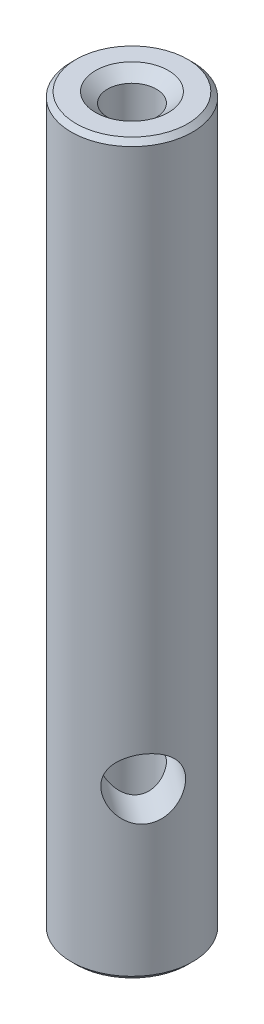
ISO-10303-21;
HEADER;
FILE_DESCRIPTION(('STEP AP214'),'2;1');
FILE_NAME('part.step','',(''),(''),'','','');
FILE_SCHEMA(('AUTOMOTIVE_DESIGN { 1 0 10303 214 1 1 1 1 }'));
ENDSEC;
DATA;
#1=APPLICATION_CONTEXT('core data for automotive mechanical design processes');
#2=APPLICATION_PROTOCOL_DEFINITION('international standard','automotive_design',2000,#1);
#3=PRODUCT_CONTEXT('',#1,'mechanical');
#4=PRODUCT('Part','Part','',(#3));
#5=PRODUCT_RELATED_PRODUCT_CATEGORY('part','',(#4));
#6=PRODUCT_DEFINITION_FORMATION('','',#4);
#7=PRODUCT_DEFINITION_CONTEXT('part definition',#1,'design');
#8=PRODUCT_DEFINITION('design','',#6,#7);
#9=PRODUCT_DEFINITION_SHAPE('','',#8);
#10=(LENGTH_UNIT() NAMED_UNIT(*) SI_UNIT(.MILLI.,.METRE.));
#11=(NAMED_UNIT(*) PLANE_ANGLE_UNIT() SI_UNIT($,.RADIAN.));
#12=(NAMED_UNIT(*) SI_UNIT($,.STERADIAN.) SOLID_ANGLE_UNIT());
#13=UNCERTAINTY_MEASURE_WITH_UNIT(LENGTH_MEASURE(1.E-05),#10,'distance_accuracy_value','');
#14=(GEOMETRIC_REPRESENTATION_CONTEXT(3) GLOBAL_UNCERTAINTY_ASSIGNED_CONTEXT((#13)) GLOBAL_UNIT_ASSIGNED_CONTEXT((#10,
#11,#12)) REPRESENTATION_CONTEXT('',''));
#15=CARTESIAN_POINT('',(0.,0.,0.));
#16=DIRECTION('',(0.,0.,1.));
#17=DIRECTION('',(1.,0.,0.));
#18=AXIS2_PLACEMENT_3D('',#15,#16,#17);
#19=CARTESIAN_POINT('',(-2.84217017566743E-11,76.1999999999858,0.));
#20=DIRECTION('',(0.,1.,0.));
#21=DIRECTION('',(0.,0.,1.));
#22=AXIS2_PLACEMENT_3D('',#19,#20,#21);
#23=CYLINDRICAL_SURFACE('',#22,2.55269999999999);
#24=CARTESIAN_POINT('',(-2.84217017566743E-11,15.0125473605394,2.55269999999999));
#25=CARTESIAN_POINT('',(0.146141609429039,14.9389517833548,2.5527050378974));
#26=CARTESIAN_POINT('',(0.29214035526825,14.8649018803599,2.54021818408022));
#27=CARTESIAN_POINT('',(0.582563562513722,14.7223370614548,2.48969257237443));
#28=CARTESIAN_POINT('',(0.726988050673868,14.6538220513539,2.45165424941309));
#29=CARTESIAN_POINT('',(0.984594154374997,14.5399736099591,2.35837658270555));
#30=CARTESIAN_POINT('',(1.09856062296888,14.4927019008149,2.30769389084834));
#31=CARTESIAN_POINT('',(1.32084218035541,14.4089016787977,2.18803734737841));
#32=CARTESIAN_POINT('',(1.42916238761089,14.3723632915375,2.11908041942248));
#33=CARTESIAN_POINT('',(1.58501902092242,14.3277733212582,2.00207104398003));
#34=CARTESIAN_POINT('',(1.63610134550729,14.31457373978,1.96056798220516));
#35=CARTESIAN_POINT('',(1.73535435039593,14.291996930548,1.87328069230012));
#36=CARTESIAN_POINT('',(1.78352652963935,14.2826177204751,1.8274986996282));
#37=CARTESIAN_POINT('',(1.87642096717843,14.2679368312076,1.73198068498581));
#38=CARTESIAN_POINT('',(1.92114453345136,14.2626335991792,1.68224617678918));
#39=CARTESIAN_POINT('',(2.00665242793614,14.2562401051936,1.57927496946938));
#40=CARTESIAN_POINT('',(2.04743730918874,14.2551492509247,1.52603876379831));
#41=CARTESIAN_POINT('',(2.15252455475854,14.2579859168976,1.37701606989338));
#42=CARTESIAN_POINT('',(2.21257580488203,14.2660997952565,1.27823058669012));
#43=CARTESIAN_POINT('',(2.31818854223108,14.2943142084616,1.07491275664707));
#44=CARTESIAN_POINT('',(2.36374932332287,14.3144153273197,0.970380130034774));
#45=CARTESIAN_POINT('',(2.43990338849989,14.3649986534765,0.758790147356919));
#46=CARTESIAN_POINT('',(2.47053373457456,14.3954548336196,0.651739741561188));
#47=CARTESIAN_POINT('',(2.51736713459012,14.4647982081429,0.43727545351543));
#48=CARTESIAN_POINT('',(2.53356465993425,14.5036886262326,0.329861447787217));
#49=CARTESIAN_POINT('',(2.55621652043224,14.6054549653817,0.0716965003333163));
#50=CARTESIAN_POINT('',(2.55576308151449,14.6715598958569,-0.0783914472887838));
#51=CARTESIAN_POINT('',(2.52961811478431,14.81092710978,-0.373280719107817));
#52=CARTESIAN_POINT('',(2.50385458747057,14.8842092747987,-0.518065739172711));
#53=CARTESIAN_POINT('',(2.44690531725036,14.9952722035224,-0.731049062962099));
#54=CARTESIAN_POINT('',(2.42461996666571,15.0327851552158,-0.801888838798563));
#55=CARTESIAN_POINT('',(2.37380357757439,15.1070891364445,-0.941739749004508));
#56=CARTESIAN_POINT('',(2.34527074855821,15.1438799557183,-1.01075035276906));
#57=CARTESIAN_POINT('',(2.28190514386588,15.2155061637808,-1.14664447695307));
#58=CARTESIAN_POINT('',(2.24708712524487,15.2503458877057,-1.21353255728077));
#59=CARTESIAN_POINT('',(2.17087723029983,15.3167167992525,-1.34511945437044));
#60=CARTESIAN_POINT('',(2.12949034473803,15.3482504687197,-1.40981988831004));
#61=CARTESIAN_POINT('',(2.03210985308377,15.4112179616136,-1.54760605605801));
#62=CARTESIAN_POINT('',(1.97482867529169,15.4417122391818,-1.6202332705475));
#63=CARTESIAN_POINT('',(1.85067735942271,15.4921364323467,-1.76068567087731));
#64=CARTESIAN_POINT('',(1.78383075606168,15.5120917287466,-1.82852204957307));
#65=CARTESIAN_POINT('',(1.6405645177049,15.5382393319012,-1.95811583398898));
#66=CARTESIAN_POINT('',(1.56405293955071,15.5442870141392,-2.01980303446706));
#67=CARTESIAN_POINT('',(1.40461853489662,15.5408572836788,-2.13376156060525));
#68=CARTESIAN_POINT('',(1.32169307869045,15.5313734705339,-2.18602899457595));
#69=CARTESIAN_POINT('',(1.1435888976898,15.4971602576053,-2.28472098452314));
#70=CARTESIAN_POINT('',(1.04804580298729,15.4709146681032,-2.32993031209417));
#71=CARTESIAN_POINT('',(0.855466487743006,15.4068592766374,-2.40734215790049));
#72=CARTESIAN_POINT('',(0.758426628001149,15.3690147732948,-2.43950496365171));
#73=CARTESIAN_POINT('',(0.588027364720411,15.296579037329,-2.4852065687524));
#74=CARTESIAN_POINT('',(0.514705898308889,15.2634718612955,-2.50137944014867));
#75=CARTESIAN_POINT('',(0.368031887906415,15.1948107759218,-2.52712761075387));
#76=CARTESIAN_POINT('',(0.294679346359718,15.1592556716299,-2.53669966230818));
#77=CARTESIAN_POINT('',(0.0745450464363469,15.0507299762198,-2.55586849629838));
#78=CARTESIAN_POINT('',(-0.0722541762948927,14.9759262309444,-2.55590251479451));
#79=CARTESIAN_POINT('',(-0.3699449179414,14.8263824593368,-2.53031355493529));
#80=CARTESIAN_POINT('',(-0.52080508977164,14.7517317582735,-2.50381478978742));
#81=CARTESIAN_POINT('',(-0.819186078418884,14.6118719592777,-2.42259702590156));
#82=CARTESIAN_POINT('',(-0.966714087875294,14.5466404676047,-2.36794641988778));
#83=CARTESIAN_POINT('',(-1.21582490193896,14.447300309655,-2.24761641384153));
#84=CARTESIAN_POINT('',(-1.31921574240825,14.4095257585208,-2.18870651711589));
#85=CARTESIAN_POINT('',(-1.51905023685118,14.3451394588842,-2.05503657595557));
#86=CARTESIAN_POINT('',(-1.61549884099471,14.3185196898157,-1.98028797836991));
#87=CARTESIAN_POINT('',(-1.7987111417712,14.2785218956048,-1.81553600876565));
#88=CARTESIAN_POINT('',(-1.88541265737466,14.2652250287037,-1.72544300587306));
#89=CARTESIAN_POINT('',(-2.0450140494866,14.253453360466,-1.53290858299129));
#90=CARTESIAN_POINT('',(-2.11791877997305,14.2549733363556,-1.43047152671874));
#91=CARTESIAN_POINT('',(-2.2411767930974,14.2718007878859,-1.22725921644502));
#92=CARTESIAN_POINT('',(-2.29302292009457,14.2857709922146,-1.127268058708));
#93=CARTESIAN_POINT('',(-2.38253544311417,14.3245728082774,-0.923161934280335));
#94=CARTESIAN_POINT('',(-2.42019836133303,14.3494070807202,-0.819045963069877));
#95=CARTESIAN_POINT('',(-2.48265775629505,14.4095413995945,-0.604728910223966));
#96=CARTESIAN_POINT('',(-2.50681894186361,14.4452519407323,-0.494460944765003));
#97=CARTESIAN_POINT('',(-2.54033101194841,14.5244534664354,-0.274555641485946));
#98=CARTESIAN_POINT('',(-2.54968000042993,14.5679454462706,-0.164918386189279));
#99=CARTESIAN_POINT('',(-2.55491023636049,14.6688502292071,0.0718812013526048));
#100=CARTESIAN_POINT('',(-2.54805273888281,14.7273584189553,0.198630574016319));
#101=CARTESIAN_POINT('',(-2.51622719500429,14.8486389964388,0.448036338301459));
#102=CARTESIAN_POINT('',(-2.4912179533282,14.9114207888803,0.570682754823789));
#103=CARTESIAN_POINT('',(-2.43684666482846,15.0127057010437,0.764103044556728));
#104=CARTESIAN_POINT('',(-2.41296228311867,15.0511530203734,0.836496357894728));
#105=CARTESIAN_POINT('',(-2.35860156572929,15.1271042353673,0.979347137712694));
#106=CARTESIAN_POINT('',(-2.3281222561036,15.1646076968589,1.04980371462425));
#107=CARTESIAN_POINT('',(-2.26047705694085,15.237296500229,1.18846917586932));
#108=CARTESIAN_POINT('',(-2.22332554574836,15.2724866088081,1.25668252746152));
#109=CARTESIAN_POINT('',(-2.14202902032723,15.3389883750079,1.39072916703798));
#110=CARTESIAN_POINT('',(-2.09789074951889,15.370303721039,1.45656467555936));
#111=CARTESIAN_POINT('',(-1.99655851387521,15.4304245928658,1.59313755043696));
#112=CARTESIAN_POINT('',(-1.93843654380419,15.4584902495188,1.66352837776898));
#113=CARTESIAN_POINT('',(-1.81305699739585,15.5037578489058,1.79933251356289));
#114=CARTESIAN_POINT('',(-1.74582490211265,15.5209893623915,1.86475893834037));
#115=CARTESIAN_POINT('',(-1.60257537977622,15.5417703819021,1.9892422183485));
#116=CARTESIAN_POINT('',(-1.52648598084436,15.5451983957279,2.04823808587992));
#117=CARTESIAN_POINT('',(-1.36859225356079,15.5372998307801,2.15695289955908));
#118=CARTESIAN_POINT('',(-1.28678153540315,15.5259564974486,2.20666123805558));
#119=CARTESIAN_POINT('',(-1.10709339146655,15.4879322360277,2.3027405876346));
#120=CARTESIAN_POINT('',(-1.00873502632267,15.4590930537089,2.34731390778756));
#121=CARTESIAN_POINT('',(-0.810806079883369,15.3900443474253,2.42284118092027));
#122=CARTESIAN_POINT('',(-0.711233303182707,15.3498098821154,2.45376487424116));
#123=CARTESIAN_POINT('',(-0.509653507504326,15.2618011795455,2.50350755545527));
#124=CARTESIAN_POINT('',(-0.407642861489981,15.213875649083,2.52203376519614));
#125=CARTESIAN_POINT('',(-0.203731693442817,15.1148892582484,2.54662782481672));
#126=CARTESIAN_POINT('',(-0.101831164642575,15.0638286031847,2.55269648960372));
#127=CARTESIAN_POINT('',(-2.84217017566743E-11,15.0125473605394,2.55269999999999));
#128=B_SPLINE_CURVE_WITH_KNOTS('',3,(#24,#25,#26,#27,#28,#29,#30,#31,#32,#33,#34,#35,#36,#37,
#38,#39,#40,#41,#42,#43,#44,#45,#46,#47,#48,#49,#50,#51,#52,#53,#54,#55,#56,#57,#58,#59,#60,#61,
#62,#63,#64,#65,#66,#67,#68,#69,#70,#71,#72,#73,#74,#75,#76,#77,#78,#79,#80,#81,#82,#83,#84,#85,
#86,#87,#88,#89,#90,#91,#92,#93,#94,#95,#96,#97,#98,#99,#100,#101,#102,#103,#104,#105,#106,#107,
#108,#109,#110,#111,#112,#113,#114,#115,#116,#117,#118,#119,#120,#121,#122,#123,#124,#125,#126,
#127),.UNSPECIFIED.,.T.,.F.,(4,2,2,2,2,2,2,2,2,2,2,2,2,2,2,2,2,2,2,2,2,2,2,2,2,2,2,2,2,2,2,2,2,
2,2,2,2,2,2,2,2,2,2,2,2,2,2,2,2,2,2,4),(0.,0.490542736328622,0.981077123039199,1.37972713135249,
1.77800923475073,1.97913385756872,2.18015398724001,2.38109749584291,2.58201274830891,
2.92781957701772,3.27364325462768,3.61860406224461,3.96369695286796,4.4531131227117,
4.94392557603005,5.19331828095783,5.44278255489782,5.69166855248637,5.94036635372294,
6.23160052983494,6.52213009722256,6.81566746361247,7.10932582562801,7.43426107957347,
7.76017811738336,8.00604347774957,8.25202971963977,8.74420081330226,9.2531711231626,
9.76091072004044,10.1339846667578,10.5067899018139,10.881852569332,11.2567830361748,
11.5957291461376,11.9347583135837,12.2886261988468,12.6425393772964,13.0604016496602,
13.4792152351628,13.7351103279579,13.991121056615,14.2465865707653,14.5018070036889,
14.7873408325788,15.0720919020333,15.3593438153143,15.6469218311102,15.9803804449556,
16.3145746304091,16.6564061339072,16.9982152758676),.UNSPECIFIED.);
#129=CARTESIAN_POINT('',(-2.84217017566743E-11,15.0125473605394,2.55269999999999));
#130=VERTEX_POINT('',#129);
#131=EDGE_CURVE('E72',#130,#130,#128,.T.);
#132=ORIENTED_EDGE('',*,*,#131,.T.);
#133=EDGE_LOOP('',(#132));
#134=FACE_BOUND('',#133,.T.);
#135=CARTESIAN_POINT('',(-2.84217017566743E-11,2.8421709430404E-11,0.));
#136=DIRECTION('',(0.,-1.,0.));
#137=DIRECTION('',(1.,0.,0.));
#138=AXIS2_PLACEMENT_3D('',#135,#136,#137);
#139=CIRCLE('',#138,2.55269999999999);
#140=CARTESIAN_POINT('',(2.55269999997157,2.8421709430404E-11,0.));
#141=VERTEX_POINT('',#140);
#142=EDGE_CURVE('E109',#141,#141,#139,.T.);
#143=ORIENTED_EDGE('',*,*,#142,.T.);
#144=EDGE_LOOP('',(#143));
#145=FACE_BOUND('',#144,.T.);
#146=ADVANCED_FACE('F33',(#134,#145),#23,.F.);
#147=CARTESIAN_POINT('',(-2.84217017566743E-11,0.50800000000005,0.));
#148=DIRECTION('',(0.,1.,0.));
#149=DIRECTION('',(-1.,0.,0.));
#150=AXIS2_PLACEMENT_3D('',#147,#148,#149);
#151=CONICAL_SURFACE('',#150,6.34618999999158,0.785398163397448);
#152=CARTESIAN_POINT('',(-2.84217017566743E-11,2.84217017566743E-11,0.));
#153=DIRECTION('',(0.,1.,0.));
#154=DIRECTION('',(-1.,0.,0.));
#155=AXIS2_PLACEMENT_3D('',#152,#153,#154);
#156=CIRCLE('',#155,5.83819000001995);
#157=CARTESIAN_POINT('',(-5.83819000004837,2.84217017566743E-11,0.));
#158=VERTEX_POINT('',#157);
#159=EDGE_CURVE('E110',#158,#158,#156,.T.);
#160=ORIENTED_EDGE('',*,*,#159,.T.);
#161=EDGE_LOOP('',(#160));
#162=FACE_BOUND('',#161,.T.);
#163=CARTESIAN_POINT('',(-2.84217017566743E-11,0.50800000000005,0.));
#164=DIRECTION('',(0.,1.,0.));
#165=DIRECTION('',(-1.,0.,0.));
#166=AXIS2_PLACEMENT_3D('',#163,#164,#165);
#167=CIRCLE('',#166,6.34618999999158);
#168=CARTESIAN_POINT('',(-6.34619000002,0.50800000000005,0.));
#169=VERTEX_POINT('',#168);
#170=EDGE_CURVE('E44',#169,#169,#167,.T.);
#171=ORIENTED_EDGE('',*,*,#170,.F.);
#172=EDGE_LOOP('',(#171));
#173=FACE_BOUND('',#172,.T.);
#174=ADVANCED_FACE('F35',(#162,#173),#151,.T.);
#175=CARTESIAN_POINT('',(-2.84217017566743E-11,2.84217017566743E-11,0.));
#176=DIRECTION('',(0.,1.,0.));
#177=DIRECTION('',(-1.,0.,0.));
#178=AXIS2_PLACEMENT_3D('',#175,#176,#177);
#179=CYLINDRICAL_SURFACE('',#178,6.34618999999158);
#180=CARTESIAN_POINT('',(2.54898186204476,17.4308110776537,5.81178277147513));
#181=CARTESIAN_POINT('',(2.54898323327409,17.3480569051967,5.81178261252406));
#182=CARTESIAN_POINT('',(2.5524146541681,17.2652927410018,5.81028164607859));
#183=CARTESIAN_POINT('',(2.56604294826318,17.1004222060484,5.804273955856));
#184=CARTESIAN_POINT('',(2.5762429659765,17.0183161589855,5.79976583502888));
#185=CARTESIAN_POINT('',(2.61672718300756,16.7737089550719,5.78167874216645));
#186=CARTESIAN_POINT('',(2.65689497225097,16.6130632684836,5.76353695910043));
#187=CARTESIAN_POINT('',(2.75980548853309,16.3023270691888,5.7149588908769));
#188=CARTESIAN_POINT('',(2.82242801763556,16.1521853489907,5.68458796263755));
#189=CARTESIAN_POINT('',(2.96595544048954,15.8643616377343,5.61103627880535));
#190=CARTESIAN_POINT('',(3.04686134211383,15.7266803341438,5.56785481698945));
#191=CARTESIAN_POINT('',(3.22993377052522,15.4551751112135,5.46384583402254));
#192=CARTESIAN_POINT('',(3.33330428541027,15.3226087134638,5.4018555488421));
#193=CARTESIAN_POINT('',(3.5513392693962,15.0770194721092,5.26107993793078));
#194=CARTESIAN_POINT('',(3.66600933322451,14.9640063869939,5.18228626966261));
#195=CARTESIAN_POINT('',(3.90967449063226,14.7532676131003,5.00130926524752));
#196=CARTESIAN_POINT('',(4.03911404876404,14.6570889897904,4.89790602565587));
#197=CARTESIAN_POINT('',(4.29902249220796,14.493581009333,4.67141940456164));
#198=CARTESIAN_POINT('',(4.42949067388308,14.4262334241323,4.5483485254733));
#199=CARTESIAN_POINT('',(4.67603856447904,14.3272805045371,4.29393726524444));
#200=CARTESIAN_POINT('',(4.79248122462589,14.2934710666038,4.16381023388753));
#201=CARTESIAN_POINT('',(5.0159322105137,14.2552946194394,3.89171805608946));
#202=CARTESIAN_POINT('',(5.12294621369068,14.2509097710486,3.74976013519462));
#203=CARTESIAN_POINT('',(5.314925530563,14.2708582761023,3.47156717230399));
#204=CARTESIAN_POINT('',(5.40099930564727,14.2927245832474,3.33590990905291));
#205=CARTESIAN_POINT('',(5.56032217584155,14.360138467768,3.06299167207883));
#206=CARTESIAN_POINT('',(5.63357031064194,14.4056878173798,2.92573057909045));
#207=CARTESIAN_POINT('',(5.76757384395485,14.5194687677039,2.6519416148298));
#208=CARTESIAN_POINT('',(5.82814256902507,14.5880051877049,2.5154501031073));
#209=CARTESIAN_POINT('',(5.93601237850887,14.7453894905337,2.24912421745351));
#210=CARTESIAN_POINT('',(5.98330870128563,14.8342446422597,2.11929224633051));
#211=CARTESIAN_POINT('',(6.06977726972029,15.0394117203801,1.85811675805679));
#212=CARTESIAN_POINT('',(6.10775752598081,15.157525996736,1.72779239140684));
#213=CARTESIAN_POINT('',(6.17152935428662,15.4129951593708,1.4840020996888));
#214=CARTESIAN_POINT('',(6.19731155071015,15.5503647408048,1.37054918806195));
#215=CARTESIAN_POINT('',(6.2405026871654,15.8513135799743,1.15874608007677));
#216=CARTESIAN_POINT('',(6.25727436713653,16.0160044430721,1.06181642640694));
#217=CARTESIAN_POINT('',(6.27638579027964,16.2741917250117,0.939578023608944));
#218=CARTESIAN_POINT('',(6.28174905785842,16.362131692208,0.902686083279713));
#219=CARTESIAN_POINT('',(6.29079524695091,16.5411528467123,0.837325344134645));
#220=CARTESIAN_POINT('',(6.29447920591737,16.6322320571265,0.80885134866542));
#221=CARTESIAN_POINT('',(6.30021054839894,16.8095126866093,0.762868607756308));
#222=CARTESIAN_POINT('',(6.30236400882379,16.8955330136969,0.744672668994656));
#223=CARTESIAN_POINT('',(6.30564218338009,17.0688775260192,0.716385141235708));
#224=CARTESIAN_POINT('',(6.30676743285755,17.1562010086573,0.706289335175847));
#225=CARTESIAN_POINT('',(6.30808438344694,17.3313931623484,0.694433232986087));
#226=CARTESIAN_POINT('',(6.30827643360786,17.4192616172478,0.692669820258223));
#227=CARTESIAN_POINT('',(6.30774274276635,17.5947380960239,0.697499309718456));
#228=CARTESIAN_POINT('',(6.30701706389248,17.6823461371277,0.704091646237829));
#229=CARTESIAN_POINT('',(6.30364947506107,17.9244747539179,0.733866552960442));
#230=CARTESIAN_POINT('',(6.29995530954081,18.0779663803931,0.765971475926918));
#231=CARTESIAN_POINT('',(6.28861303789462,18.3776688456908,0.854046119764477));
#232=CARTESIAN_POINT('',(6.28096364919271,18.5238773059008,0.910023580846323));
#233=CARTESIAN_POINT('',(6.25983589722089,18.8126955862098,1.04570259881783));
#234=CARTESIAN_POINT('',(6.24610400671688,18.9548252176271,1.12638274099009));
#235=CARTESIAN_POINT('',(6.21092688595921,19.2256059502302,1.30649444349513));
#236=CARTESIAN_POINT('',(6.18947768880845,19.3542500755164,1.40593563497067));
#237=CARTESIAN_POINT('',(6.13362509434063,19.6114078054789,1.63344516931152));
#238=CARTESIAN_POINT('',(6.09792820901346,19.7378548963292,1.76354264414182));
#239=CARTESIAN_POINT('',(6.01178515289824,19.9684622925735,2.03795079493238));
#240=CARTESIAN_POINT('',(5.96133399458648,20.0726150409505,2.1822662661767));
#241=CARTESIAN_POINT('',(5.84217163684326,20.2580125732565,2.48397213565325));
#242=CARTESIAN_POINT('',(5.77301178261527,20.3385768027511,2.64160774109461));
#243=CARTESIAN_POINT('',(5.61628360338484,20.4694980506625,2.96021882375603));
#244=CARTESIAN_POINT('',(5.52873155350879,20.5198816249172,3.12119123549864));
#245=CARTESIAN_POINT('',(5.34522325442687,20.5846636736303,3.42509797707477));
#246=CARTESIAN_POINT('',(5.25077688863443,20.6019415927001,3.56833138814324));
#247=CARTESIAN_POINT('',(5.05016776650217,20.6085137388476,3.84699391171806));
#248=CARTESIAN_POINT('',(4.94400913428837,20.5978177861605,3.98242574591092));
#249=CARTESIAN_POINT('',(4.73108741797625,20.5506516030801,4.23275134203897));
#250=CARTESIAN_POINT('',(4.62482700714659,20.5159297219663,4.34841073974499));
#251=CARTESIAN_POINT('',(4.4090580267121,20.4240564114695,4.56704949870963));
#252=CARTESIAN_POINT('',(4.29954899391063,20.3669017692197,4.67002704086977));
#253=CARTESIAN_POINT('',(4.07637982811242,20.2292459693696,4.8662388103024));
#254=CARTESIAN_POINT('',(3.96274229835076,20.1478514564257,4.95886856865993));
#255=CARTESIAN_POINT('',(3.74014454954153,19.9651403066869,5.12884892859431));
#256=CARTESIAN_POINT('',(3.63118650644422,19.8638145215203,5.20619248106094));
#257=CARTESIAN_POINT('',(3.41158908490591,19.6324444144576,5.35297314351558));
#258=CARTESIAN_POINT('',(3.3018636258708,19.5005446816285,5.42085493023726));
#259=CARTESIAN_POINT('',(3.09840446215224,19.2177314273344,5.53966871208602));
#260=CARTESIAN_POINT('',(3.0046849557482,19.0668012288077,5.59058569604841));
#261=CARTESIAN_POINT('',(2.8794041254054,18.8260858806462,5.65557019556782));
#262=CARTESIAN_POINT('',(2.83969631741779,18.7420143659253,5.67555233126463));
#263=CARTESIAN_POINT('',(2.76700441864716,18.5701746933921,5.71134438918446));
#264=CARTESIAN_POINT('',(2.73401686527789,18.4824084675386,5.72715646126065));
#265=CARTESIAN_POINT('',(2.67562857750121,18.3040181069106,5.75466596558073));
#266=CARTESIAN_POINT('',(2.65020834048433,18.2134019959436,5.76637398893116));
#267=CARTESIAN_POINT('',(2.60754565870225,18.0298913979354,5.78579173663697));
#268=CARTESIAN_POINT('',(2.59029749906276,17.9369985510089,5.79350425547103));
#269=CARTESIAN_POINT('',(2.56797069895927,17.7751479136484,5.80342623934202));
#270=CARTESIAN_POINT('',(2.56086151063149,17.706519610065,5.80656030281969));
#271=CARTESIAN_POINT('',(2.55136636213252,17.5688668985843,5.81073870514046));
#272=CARTESIAN_POINT('',(2.54898071820078,17.4998424644765,5.81178290406799));
#273=CARTESIAN_POINT('',(2.54898186204476,17.4308110776537,5.81178277147513));
#274=B_SPLINE_CURVE_WITH_KNOTS('',3,(#180,#181,#182,#183,#184,#185,#186,#187,#188,#189,#190,
#191,#192,#193,#194,#195,#196,#197,#198,#199,#200,#201,#202,#203,#204,#205,#206,#207,#208,#209,
#210,#211,#212,#213,#214,#215,#216,#217,#218,#219,#220,#221,#222,#223,#224,#225,#226,#227,#228,
#229,#230,#231,#232,#233,#234,#235,#236,#237,#238,#239,#240,#241,#242,#243,#244,#245,#246,#247,
#248,#249,#250,#251,#252,#253,#254,#255,#256,#257,#258,#259,#260,#261,#262,#263,#264,#265,#266,
#267,#268,#269,#270,#271,#272,#273),.UNSPECIFIED.,.T.,.F.,(4,2,2,2,2,2,2,2,2,2,2,2,2,2,2,2,2,2,
2,2,2,2,2,2,2,2,2,2,2,2,2,2,2,2,2,2,2,2,2,2,2,2,2,2,2,2,4),(0.,0.248186916575524,
0.496489215069263,0.993521260690589,1.48793151747673,1.98236903533008,2.517638451749,
3.05317423979837,3.62486308277466,4.19618994710279,4.72682370446812,5.25713572697523,
5.7412773741896,6.22545525563859,6.71632560901302,7.20737184364814,7.74487649783145,
8.28279361811226,8.85494225388807,9.14113314058491,9.4271469822429,9.69062561821036,
9.95396699368775,10.21720986275,10.4804349117102,10.948673159139,11.4170633393631,
11.9071439758319,12.3974768872906,12.9497078461558,13.5021256969785,14.069189462767,
14.6357535356872,15.1502941641982,15.6646541873305,16.1450540492872,16.6255227402327,
17.1265248437367,17.6277574440001,18.1789253055149,18.7305795761178,19.0155482113871,
19.3003696441842,19.5844505460175,19.8683324908886,20.075349727878,20.2823808241212),.UNSPECIFIED.);
#275=CARTESIAN_POINT('',(2.54898186204476,17.4308110776537,5.81178277147513));
#276=VERTEX_POINT('',#275);
#277=EDGE_CURVE('E37',#276,#276,#274,.T.);
#278=ORIENTED_EDGE('',*,*,#277,.F.);
#279=EDGE_LOOP('',(#278));
#280=FACE_BOUND('',#279,.T.);
#281=CARTESIAN_POINT('',(-6.30812514689882,17.4308110776537,-0.694035047684538));
#282=CARTESIAN_POINT('',(-6.30812540534921,17.5135652501108,-0.694036403685538));
#283=CARTESIAN_POINT('',(-6.30771946174829,17.5963294143056,-0.697759676360909));
#284=CARTESIAN_POINT('',(-6.30606290944521,17.761199949259,-0.7125609795542));
#285=CARTESIAN_POINT('',(-6.30481190814659,17.843305996322,-0.723642428489012));
#286=CARTESIAN_POINT('',(-6.29966132349498,18.0879132002355,-0.767683162299635));
#287=CARTESIAN_POINT('',(-6.29436391075932,18.2485588868238,-0.811438310611869));
#288=CARTESIAN_POINT('',(-6.27878938656816,18.5592950861187,-0.924167354207574));
#289=CARTESIAN_POINT('',(-6.26853868986794,18.7094368063167,-0.993007005938747));
#290=CARTESIAN_POINT('',(-6.24128198283391,18.9972605175731,-1.15196311065737));
#291=CARTESIAN_POINT('',(-6.22427560005303,19.1349418211636,-1.24208073660762));
#292=CARTESIAN_POINT('',(-6.17978344994018,19.4064470440939,-1.44788120104001));
#293=CARTESIAN_POINT('',(-6.15154824995145,19.5390134418437,-1.56506068851947));
#294=CARTESIAN_POINT('',(-6.0824295648973,19.7846026831983,-1.81521990631003));
#295=CARTESIAN_POINT('',(-6.04153979252789,19.8976157683136,-1.94820747043961));
#296=CARTESIAN_POINT('',(-5.94172578550691,20.1083545422071,-2.23484757416556));
#297=CARTESIAN_POINT('',(-5.88177042611225,20.2045331655171,-2.38928909723256));
#298=CARTESIAN_POINT('',(-5.74338830988848,20.3680411459745,-2.70504054761332));
#299=CARTESIAN_POINT('',(-5.66497327270906,20.4353887311751,-2.86634606411336));
#300=CARTESIAN_POINT('',(-5.49594874805748,20.5343416507703,-3.17770062366702));
#301=CARTESIAN_POINT('',(-5.40660562419645,20.5681510887036,-3.32773309885353));
#302=CARTESIAN_POINT('',(-5.21380141911104,20.6063275358681,-3.6223362808026));
#303=CARTESIAN_POINT('',(-5.11034893075801,20.6107123842588,-3.76691024399899));
#304=CARTESIAN_POINT('',(-4.90231024999981,20.5907638792051,-4.03330710962812));
#305=CARTESIAN_POINT('',(-4.79860692110092,20.56889757206,-4.15601492276697));
#306=CARTESIAN_POINT('',(-4.58583419048415,20.5014836875395,-4.38967259147455));
#307=CARTESIAN_POINT('',(-4.47676438773834,20.4559343379277,-4.50062156636433));
#308=CARTESIAN_POINT('',(-4.25558794810156,20.3421533876035,-4.71037934677035));
#309=CARTESIAN_POINT('',(-4.14346017361485,20.2736169676026,-4.80899914913063));
#310=CARTESIAN_POINT('',(-3.92158876432153,20.1162326647737,-4.99158734947651));
#311=CARTESIAN_POINT('',(-3.81184599815912,20.0273775130478,-5.07555048513085));
#312=CARTESIAN_POINT('',(-3.58848825664595,19.8222104349273,-5.23617666079437));
#313=CARTESIAN_POINT('',(-3.47548926321691,19.7040961585714,-5.31139745507595));
#314=CARTESIAN_POINT('',(-3.26193245260258,19.4486269959367,-5.44516606522671));
#315=CARTESIAN_POINT('',(-3.16138424896993,19.3112574145026,-5.50370104242223));
#316=CARTESIAN_POINT('',(-2.97219483022993,19.0103085753331,-5.60826391660468));
#317=CARTESIAN_POINT('',(-2.88471853081534,18.8456177122353,-5.65325885021212));
#318=CARTESIAN_POINT('',(-2.77379181877469,18.5874304302958,-5.70805609621052));
#319=CARTESIAN_POINT('',(-2.74019276348295,18.4994904630995,-5.72420798105036));
#320=CARTESIAN_POINT('',(-2.6805296360084,18.3204693085951,-5.75238902039674));
#321=CARTESIAN_POINT('',(-2.65446091534965,18.2293900981809,-5.76442071914896));
#322=CARTESIAN_POINT('',(-2.61229728938271,18.0521094686981,-5.78364282604378));
#323=CARTESIAN_POINT('',(-2.59557837464689,17.9660891416105,-5.79113999012598));
#324=CARTESIAN_POINT('',(-2.56956621860009,17.7927446292882,-5.80272870847324));
#325=CARTESIAN_POINT('',(-2.56026911338548,17.7054211466502,-5.80682203487278));
#326=CARTESIAN_POINT('',(-2.54934962798837,17.530228992959,-5.81162477957255));
#327=CARTESIAN_POINT('',(-2.5477243782717,17.4423605380597,-5.81233546309677));
#328=CARTESIAN_POINT('',(-2.552173169357,17.2668840592835,-5.81038173531629));
#329=CARTESIAN_POINT('',(-2.55824668896656,17.1792760181797,-5.80771755248379));
#330=CARTESIAN_POINT('',(-2.58565139440009,16.9371474013895,-5.79559864803748));
#331=CARTESIAN_POINT('',(-2.61518178021495,16.7836557749144,-5.78247122440601));
#332=CARTESIAN_POINT('',(-2.69583231628052,16.4839533096167,-5.7453056348702));
#333=CARTESIAN_POINT('',(-2.74695946881579,16.3377448494066,-5.72126393005715));
#334=CARTESIAN_POINT('',(-2.87010846720237,16.0489265690977,-5.66052265893547));
#335=CARTESIAN_POINT('',(-2.94298827427824,15.9067969376804,-5.62328848272148));
#336=CARTESIAN_POINT('',(-3.10433393307559,15.6360162050773,-5.53585145628923));
#337=CARTESIAN_POINT('',(-3.19280778859209,15.507372079791,-5.48564194015403));
#338=CARTESIAN_POINT('',(-3.39319769968769,15.2502143498286,-5.36429951535594));
#339=CARTESIAN_POINT('',(-3.50666312811974,15.1237672589783,-5.29132543002415));
#340=CARTESIAN_POINT('',(-3.74274515122489,14.8931598627339,-5.12705206729074));
#341=CARTESIAN_POINT('',(-3.86536482993856,14.7890071143569,-5.03574659643809));
#342=CARTESIAN_POINT('',(-4.11761914222628,14.6036095820509,-4.83180086563752));
#343=CARTESIAN_POINT('',(-4.24735356880819,14.5230453525564,-4.71865914875482));
#344=CARTESIAN_POINT('',(-4.50450356000494,14.392124104645,-4.47381097909232));
#345=CARTESIAN_POINT('',(-4.63192106724669,14.3417405303902,-4.3421209732907));
#346=CARTESIAN_POINT('',(-4.8670300740694,14.2769584816772,-4.0761165403987));
#347=CARTESIAN_POINT('',(-4.97545855990432,14.2596805626074,-3.9431534270279));
#348=CARTESIAN_POINT('',(-5.18136419106237,14.2531084164598,-3.66838135241847));
#349=CARTESIAN_POINT('',(-5.27884516698171,14.2638043691469,-3.52657551248175));
#350=CARTESIAN_POINT('',(-5.45402841160173,14.3109705522274,-3.24852984688244));
#351=CARTESIAN_POINT('',(-5.53261161439944,14.3456924333411,-3.11254068766207));
#352=CARTESIAN_POINT('',(-5.67670692388277,14.437565743838,-2.84125541046436));
#353=CARTESIAN_POINT('',(-5.74221715620217,14.4947203860878,-2.70595939457359));
#354=CARTESIAN_POINT('',(-5.86269875109161,14.6323761859379,-2.43432044243335));
#355=CARTESIAN_POINT('',(-5.91710007543743,14.7137706988818,-2.29817986724311));
#356=CARTESIAN_POINT('',(-6.01272193885869,14.8964818486205,-2.03493180974942));
#357=CARTESIAN_POINT('',(-6.05393640231637,14.9978076337871,-1.90782851213032));
#358=CARTESIAN_POINT('',(-6.1283179368199,15.2291777408498,-1.65438230927497));
#359=CARTESIAN_POINT('',(-6.16027422823676,15.361077473679,-1.52937667433048));
#360=CARTESIAN_POINT('',(-6.21279593868521,15.6438907279731,-1.29969468550717));
#361=CARTESIAN_POINT('',(-6.2333512803125,15.7948209264998,-1.19503636970271));
#362=CARTESIAN_POINT('',(-6.25789040598127,16.0355362746612,-1.05605398614068));
#363=CARTESIAN_POINT('',(-6.26508150445944,16.1196077893821,-1.01218732608017));
#364=CARTESIAN_POINT('',(-6.27749349327985,16.2914474619153,-0.932117818210207));
#365=CARTESIAN_POINT('',(-6.28271539942759,16.3792136877688,-0.895911023311771));
#366=CARTESIAN_POINT('',(-6.29150208955605,16.5576040483968,-0.831967618225597));
#367=CARTESIAN_POINT('',(-6.29507114672707,16.6482201593639,-0.804209230453997));
#368=CARTESIAN_POINT('',(-6.30083991017442,16.831730757372,-0.757691763722735));
#369=CARTESIAN_POINT('',(-6.30304057372939,16.9246236042986,-0.738926395683895));
#370=CARTESIAN_POINT('',(-6.30583057509847,17.086474241659,-0.714654031580712));
#371=CARTESIAN_POINT('',(-6.30669486390412,17.1551025452424,-0.706932897115984));
#372=CARTESIAN_POINT('',(-6.30784206147085,17.2927552567231,-0.696622667791934));
#373=CARTESIAN_POINT('',(-6.3081249313062,17.3617796908309,-0.694033916543633));
#374=CARTESIAN_POINT('',(-6.30812514689882,17.4308110776537,-0.694035047684538));
#375=B_SPLINE_CURVE_WITH_KNOTS('',3,(#281,#282,#283,#284,#285,#286,#287,#288,#289,#290,#291,
#292,#293,#294,#295,#296,#297,#298,#299,#300,#301,#302,#303,#304,#305,#306,#307,#308,#309,#310,
#311,#312,#313,#314,#315,#316,#317,#318,#319,#320,#321,#322,#323,#324,#325,#326,#327,#328,#329,
#330,#331,#332,#333,#334,#335,#336,#337,#338,#339,#340,#341,#342,#343,#344,#345,#346,#347,#348,
#349,#350,#351,#352,#353,#354,#355,#356,#357,#358,#359,#360,#361,#362,#363,#364,#365,#366,#367,
#368,#369,#370,#371,#372,#373,#374),.UNSPECIFIED.,.T.,.F.,(4,2,2,2,2,2,2,2,2,2,2,2,2,2,2,2,2,2,
2,2,2,2,2,2,2,2,2,2,2,2,2,2,2,2,2,2,2,2,2,2,2,2,2,2,2,2,4),(0.,0.248186916575524,
0.496489215069263,0.99352126069059,1.48793151747673,1.98236903533008,2.517638451749,
3.05317423979837,3.62486308277467,4.19618994710279,4.72682370446813,5.25713572697523,
5.74127737418961,6.22545525563859,6.71632560901303,7.20737184364815,7.74487649783145,
8.28279361811227,8.85494225388807,9.14113314058491,9.4271469822429,9.69062561821037,
9.95396699368775,10.21720986275,10.4804349117102,10.948673159139,11.4170633393631,
11.9071439758319,12.3974768872906,12.9497078461558,13.5021256969785,14.069189462767,
14.6357535356872,15.1502941641982,15.6646541873305,16.1450540492872,16.6255227402327,
17.1265248437367,17.6277574440001,18.1789253055149,18.7305795761178,19.0155482113871,
19.3003696441842,19.5844505460175,19.8683324908886,20.075349727878,20.2823808241212),.UNSPECIFIED.);
#376=CARTESIAN_POINT('',(-6.30812514689882,17.4308110776537,-0.694035047684538));
#377=VERTEX_POINT('',#376);
#378=EDGE_CURVE('E10',#377,#377,#375,.T.);
#379=ORIENTED_EDGE('',*,*,#378,.F.);
#380=EDGE_LOOP('',(#379));
#381=FACE_BOUND('',#380,.T.);
#382=ORIENTED_EDGE('',*,*,#170,.T.);
#383=EDGE_LOOP('',(#382));
#384=FACE_BOUND('',#383,.T.);
#385=CARTESIAN_POINT('',(-2.84217017566743E-11,75.692,0.));
#386=DIRECTION('',(0.,1.,0.));
#387=DIRECTION('',(-1.,0.,0.));
#388=AXIS2_PLACEMENT_3D('',#385,#386,#387);
#389=CIRCLE('',#388,6.34618999999159);
#390=CARTESIAN_POINT('',(-6.34619000002001,75.692,0.));
#391=VERTEX_POINT('',#390);
#392=EDGE_CURVE('E48',#391,#391,#389,.T.);
#393=ORIENTED_EDGE('',*,*,#392,.F.);
#394=EDGE_LOOP('',(#393));
#395=FACE_BOUND('',#394,.T.);
#396=ADVANCED_FACE('F53',(#280,#381,#384,#395),#179,.T.);
#397=CARTESIAN_POINT('',(-2.84217017566743E-11,76.1999999999858,0.));
#398=DIRECTION('',(0.,-1.,0.));
#399=DIRECTION('',(1.,0.,0.));
#400=AXIS2_PLACEMENT_3D('',#397,#398,#399);
#401=CONICAL_SURFACE('',#400,5.83819000000581,0.785398163397442);
#402=ORIENTED_EDGE('',*,*,#392,.T.);
#403=EDGE_LOOP('',(#402));
#404=FACE_BOUND('',#403,.T.);
#405=CARTESIAN_POINT('',(-2.84217017566743E-11,76.1999999999858,0.));
#406=DIRECTION('',(0.,1.,0.));
#407=DIRECTION('',(-1.,0.,0.));
#408=AXIS2_PLACEMENT_3D('',#405,#406,#407);
#409=CIRCLE('',#408,5.83819000000581);
#410=CARTESIAN_POINT('',(-5.83819000003423,76.1999999999858,0.));
#411=VERTEX_POINT('',#410);
#412=EDGE_CURVE('E114',#411,#411,#409,.T.);
#413=ORIENTED_EDGE('',*,*,#412,.F.);
#414=EDGE_LOOP('',(#413));
#415=FACE_BOUND('',#414,.T.);
#416=ADVANCED_FACE('F88',(#404,#415),#401,.T.);
#417=CARTESIAN_POINT('',(-2.84217017566743E-11,76.1999999999858,0.));
#418=DIRECTION('',(0.,1.,0.));
#419=DIRECTION('',(-1.,0.,0.));
#420=AXIS2_PLACEMENT_3D('',#417,#418,#419);
#421=PLANE('',#420);
#422=CARTESIAN_POINT('',(-2.84217017566743E-11,76.1999999999858,0.));
#423=DIRECTION('',(0.,1.,0.));
#424=DIRECTION('',(0.,0.,1.));
#425=AXIS2_PLACEMENT_3D('',#422,#423,#424);
#426=CIRCLE('',#425,3.81);
#427=CARTESIAN_POINT('',(-2.84217017566743E-11,76.1999999999858,3.81));
#428=VERTEX_POINT('',#427);
#429=EDGE_CURVE('E117',#428,#428,#426,.T.);
#430=ORIENTED_EDGE('',*,*,#429,.F.);
#431=EDGE_LOOP('',(#430));
#432=FACE_BOUND('',#431,.T.);
#433=ORIENTED_EDGE('',*,*,#412,.T.);
#434=EDGE_LOOP('',(#433));
#435=FACE_BOUND('',#434,.T.);
#436=ADVANCED_FACE('F85',(#432,#435),#421,.T.);
#437=CARTESIAN_POINT('',(5.83818999999153,2.84217017566743E-11,0.));
#438=DIRECTION('',(0.,-1.,0.));
#439=DIRECTION('',(1.,0.,0.));
#440=AXIS2_PLACEMENT_3D('',#437,#438,#439);
#441=PLANE('',#440);
#442=ORIENTED_EDGE('',*,*,#142,.F.);
#443=EDGE_LOOP('',(#442));
#444=FACE_BOUND('',#443,.T.);
#445=ORIENTED_EDGE('',*,*,#159,.F.);
#446=EDGE_LOOP('',(#445));
#447=FACE_BOUND('',#446,.T.);
#448=ADVANCED_FACE('F80',(#444,#447),#441,.T.);
#449=CARTESIAN_POINT('',(-2.84217017566743E-11,19.8490747947681,2.55269999999999));
#450=CARTESIAN_POINT('',(-0.125820243199261,19.7857013477421,2.55270395792269));
#451=CARTESIAN_POINT('',(-0.251801143531641,19.7226361281467,2.54344782258984));
#452=CARTESIAN_POINT('',(-0.503830665768352,19.6024050615792,2.50572337140219));
#453=CARTESIAN_POINT('',(-0.629879171615461,19.5452349535636,2.47726904600595));
#454=CARTESIAN_POINT('',(-0.845349957914293,19.4590703921315,2.41049437793727));
#455=CARTESIAN_POINT('',(-0.934972057929935,19.42668956487,2.37729732292264));
#456=CARTESIAN_POINT('',(-1.11251878572325,19.3730037099652,2.29954889854163));
#457=CARTESIAN_POINT('',(-1.20044715489326,19.3516706882312,2.25502665772878));
#458=CARTESIAN_POINT('',(-1.37332254324941,19.3236838533062,2.15414776495121));
#459=CARTESIAN_POINT('',(-1.45822342364146,19.3172023531697,2.09766042024534));
#460=CARTESIAN_POINT('',(-1.62039134475358,19.3209676883025,1.97508316082942));
#461=CARTESIAN_POINT('',(-1.69765534066438,19.3312211674672,1.90898944181685));
#462=CARTESIAN_POINT('',(-1.84751122157602,19.3674454887656,1.76483234893947));
#463=CARTESIAN_POINT('',(-1.91930170184565,19.394551667324,1.68624103306668));
#464=CARTESIAN_POINT('',(-2.05072587842237,19.4602743125012,1.52374190929911));
#465=CARTESIAN_POINT('',(-2.11032211869442,19.498925372083,1.43981872862721));
#466=CARTESIAN_POINT('',(-2.20450769547375,19.5726453128869,1.28927971320152));
#467=CARTESIAN_POINT('',(-2.24164040923273,19.6062500110561,1.2234949021397));
#468=CARTESIAN_POINT('',(-2.30954443540345,19.6758297229377,1.08990641860059));
#469=CARTESIAN_POINT('',(-2.34031266647565,19.7118058737166,1.02210178632342));
#470=CARTESIAN_POINT('',(-2.42340531107406,19.8214723822947,0.815734234445688));
#471=CARTESIAN_POINT('',(-2.46649028272764,19.8968773329342,0.674262102080837));
#472=CARTESIAN_POINT('',(-2.52888663473226,20.0471104711026,0.379939406623316));
#473=CARTESIAN_POINT('',(-2.54739145964632,20.1218426448598,0.226869454488346));
#474=CARTESIAN_POINT('',(-2.55602105119645,20.2613868379447,-0.0844246920814273));
#475=CARTESIAN_POINT('',(-2.54621693599607,20.3262232863098,-0.242634984844652));
#476=CARTESIAN_POINT('',(-2.50260600515998,20.4238873517796,-0.516592474365568));
#477=CARTESIAN_POINT('',(-2.47610148802863,20.4606189774936,-0.632112549774668));
#478=CARTESIAN_POINT('',(-2.40607004572355,20.5228654920087,-0.861041938616714));
#479=CARTESIAN_POINT('',(-2.36255568953164,20.548388633528,-0.974452745965932));
#480=CARTESIAN_POINT('',(-2.25834580835979,20.5862176757114,-1.1963486874475));
#481=CARTESIAN_POINT('',(-2.19755215343412,20.5984461039765,-1.30480145887054));
#482=CARTESIAN_POINT('',(-2.06039989957538,20.6082370925585,-1.512103488981));
#483=CARTESIAN_POINT('',(-1.98404596027621,20.6058040371405,-1.61095560959451));
#484=CARTESIAN_POINT('',(-1.82618859177841,20.5874253123928,-1.78718288568349));
#485=CARTESIAN_POINT('',(-1.7457958801638,20.5727366253944,-1.86569561925612));
#486=CARTESIAN_POINT('',(-1.57702210412781,20.5326226403808,-2.01038356048012));
#487=CARTESIAN_POINT('',(-1.48863896337763,20.5071945453703,-2.0765555476033));
#488=CARTESIAN_POINT('',(-1.30186363638895,20.4458270063351,-2.19874961864901));
#489=CARTESIAN_POINT('',(-1.20319284079813,20.4094312929636,-2.25411076825161));
#490=CARTESIAN_POINT('',(-1.00212497291252,20.3289444757038,-2.35041770988815));
#491=CARTESIAN_POINT('',(-0.899727502352234,20.2848525474071,-2.39136195618328));
#492=CARTESIAN_POINT('',(-0.673864424439587,20.1826222460229,-2.46552183280073));
#493=CARTESIAN_POINT('',(-0.549981622357453,20.1233911354184,-2.49593939897275));
#494=CARTESIAN_POINT('',(-0.300743296401198,20.0008339643498,-2.5380825000976));
#495=CARTESIAN_POINT('',(-0.17538491103639,19.937498240285,-2.54976212379973));
#496=CARTESIAN_POINT('',(0.0267040340159789,19.8355983360493,-2.55370793626877));
#497=CARTESIAN_POINT('',(0.103351146279253,19.7969972412444,-2.5517649661337));
#498=CARTESIAN_POINT('',(0.256765760367567,19.7208868716844,-2.54091850897834));
#499=CARTESIAN_POINT('',(0.333533302138136,19.6833781255363,-2.53201170823928));
#500=CARTESIAN_POINT('',(0.486885122782928,19.6108987747122,-2.507038083828));
#501=CARTESIAN_POINT('',(0.563469379907671,19.5759220578282,-2.49098921981607));
#502=CARTESIAN_POINT('',(0.716423913863162,19.5101308010432,-2.45137684567027));
#503=CARTESIAN_POINT('',(0.792794330372818,19.4793119723315,-2.42782116439376));
#504=CARTESIAN_POINT('',(0.952820957791106,19.4210942174144,-2.36988698323339));
#505=CARTESIAN_POINT('',(1.03642256538205,19.3943684929097,-2.33464732159535));
#506=CARTESIAN_POINT('',(1.20144542555728,19.3519454686571,-2.25414949155147));
#507=CARTESIAN_POINT('',(1.28287191469127,19.336218844528,-2.20891838848837));
#508=CARTESIAN_POINT('',(1.44198853659848,19.3184027269588,-2.10851659725348));
#509=CARTESIAN_POINT('',(1.51964368951315,19.3164229999016,-2.05326951095119));
#510=CARTESIAN_POINT('',(1.66773001155706,19.3268124509503,-1.93493285357966));
#511=CARTESIAN_POINT('',(1.73815304279075,19.3391976045659,-1.87183462079718));
#512=CARTESIAN_POINT('',(1.8824968408812,19.3794612446291,-1.7276545852999));
#513=CARTESIAN_POINT('',(1.95454826187244,19.4098324798949,-1.64543160342833));
#514=CARTESIAN_POINT('',(2.0857249847027,19.4818588876283,-1.47567423048155));
#515=CARTESIAN_POINT('',(2.14481076344537,19.5235477185733,-1.38812461046666));
#516=CARTESIAN_POINT('',(2.23728064174729,19.6019590873031,-1.2316228196751));
#517=CARTESIAN_POINT('',(2.27338983960966,19.6372875298007,-1.16354096909754));
#518=CARTESIAN_POINT('',(2.33899149275395,19.7100091892526,-1.02530521240385));
#519=CARTESIAN_POINT('',(2.36848088624454,19.7474033517209,-0.955150364391093));
#520=CARTESIAN_POINT('',(2.44730985491059,19.8608594941689,-0.741630043787056));
#521=CARTESIAN_POINT('',(2.48698898447003,19.9381755247844,-0.595245212857569));
#522=CARTESIAN_POINT('',(2.54072613475953,20.0902483715643,-0.291999459827398));
#523=CARTESIAN_POINT('',(2.55414286523973,20.1648984276401,-0.134970989488381));
#524=CARTESIAN_POINT('',(2.55102416713357,20.3025080797098,0.183752183308453));
#525=CARTESIAN_POINT('',(2.53457582069636,20.3655010759782,0.345431970763839));
#526=CARTESIAN_POINT('',(2.47898618572827,20.4567011583422,0.619837031369275));
#527=CARTESIAN_POINT('',(2.44814974745192,20.4896730958723,0.732672920423973));
#528=CARTESIAN_POINT('',(2.37008855092779,20.5442194198261,0.955429243210614));
#529=CARTESIAN_POINT('',(2.32287634120869,20.565802501536,1.06535184013299));
#530=CARTESIAN_POINT('',(2.21224097536256,20.5958553448744,1.27939128883136));
#531=CARTESIAN_POINT('',(2.14874053661088,20.6042611936449,1.38347749735866));
#532=CARTESIAN_POINT('',(2.00738648686173,20.6069673938795,1.58160552447658));
#533=CARTESIAN_POINT('',(1.92953454530972,20.6012693850245,1.67564850934256));
#534=CARTESIAN_POINT('',(1.76860423415784,20.5772608972789,1.84414653606725));
#535=CARTESIAN_POINT('',(1.68635406339241,20.5599270496717,1.91954112925527));
#536=CARTESIAN_POINT('',(1.5145305988161,20.5149646116502,2.05782565589922));
#537=CARTESIAN_POINT('',(1.42495550196597,20.4873334805571,2.12071249740324));
#538=CARTESIAN_POINT('',(1.23447959844264,20.4213358182062,2.23733419640183));
#539=CARTESIAN_POINT('',(1.13322389689828,20.3823593542734,2.29013625028615));
#540=CARTESIAN_POINT('',(0.92731913603616,20.2970223794995,2.38097406551564));
#541=CARTESIAN_POINT('',(0.822668800965325,20.2506590663563,2.41900420403383));
#542=CARTESIAN_POINT('',(0.599056703648684,20.1471028761574,2.48446166018869));
#543=CARTESIAN_POINT('',(0.47986842072753,20.0892777388633,2.51009878173661));
#544=CARTESIAN_POINT('',(0.240502917106868,19.9705677879567,2.54422355906276));
#545=CARTESIAN_POINT('',(0.120324923498511,19.9096803457897,2.55269621494336));
#546=CARTESIAN_POINT('',(-2.84217017566743E-11,19.8490747947681,2.55269999999999));
#547=B_SPLINE_CURVE_WITH_KNOTS('',3,(#449,#450,#451,#452,#453,#454,#455,#456,#457,#458,#459,
#460,#461,#462,#463,#464,#465,#466,#467,#468,#469,#470,#471,#472,#473,#474,#475,#476,#477,#478,
#479,#480,#481,#482,#483,#484,#485,#486,#487,#488,#489,#490,#491,#492,#493,#494,#495,#496,#497,
#498,#499,#500,#501,#502,#503,#504,#505,#506,#507,#508,#509,#510,#511,#512,#513,#514,#515,#516,
#517,#518,#519,#520,#521,#522,#523,#524,#525,#526,#527,#528,#529,#530,#531,#532,#533,#534,#535,
#536,#537,#538,#539,#540,#541,#542,#543,#544,#545,#546),.UNSPECIFIED.,.T.,.F.,(4,2,2,2,2,2,2,2,
2,2,2,2,2,2,2,2,2,2,2,2,2,2,2,2,2,2,2,2,2,2,2,2,2,2,2,2,2,2,2,2,2,2,2,2,2,2,2,2,4),(0.,
0.42235171750369,0.844395983046162,1.14615326198185,1.44714212856746,1.75160587544891,
2.05619052581977,2.38392449020437,2.71265049627416,2.96037391754079,3.20821699386819,
3.70407287150606,4.21582756073605,4.72629773123174,5.09708147651564,5.46759175705368,
5.84024973059592,6.21279627270117,6.55124925426137,6.88979043767886,7.24501588909559,
7.60027941517191,8.02075219149176,8.44225363518098,8.69953012823935,8.9569291201416,
9.21368447396116,9.47017292919764,9.75292171267884,10.0349137643407,10.3191549065249,
10.6037124630825,10.9422336343786,11.2817728088647,11.535786348405,11.7899171332996,
12.2983165551717,12.8189827217248,13.3381331400687,13.7012735773668,14.0641363576667,
14.4287537266687,14.7933287081137,15.1305972565232,15.4679490753379,15.8286143398731,
16.1894167549162,16.5929693468701,16.9968744485404),.UNSPECIFIED.);
#548=CARTESIAN_POINT('',(-2.84217017566743E-11,19.8490747947681,2.55269999999999));
#549=VERTEX_POINT('',#548);
#550=EDGE_CURVE('E68',#549,#549,#547,.T.);
#551=ORIENTED_EDGE('',*,*,#550,.T.);
#552=EDGE_LOOP('',(#551));
#553=FACE_BOUND('',#552,.T.);
#554=CARTESIAN_POINT('',(-2.84217017566743E-11,75.1450000337066,0.));
#555=DIRECTION('',(0.,1.,0.));
#556=DIRECTION('',(0.,0.,1.));
#557=AXIS2_PLACEMENT_3D('',#554,#555,#556);
#558=CIRCLE('',#557,2.5527);
#559=CARTESIAN_POINT('',(-2.84217017566743E-11,75.1450000337066,2.5527));
#560=VERTEX_POINT('',#559);
#561=EDGE_CURVE('E111',#560,#560,#558,.T.);
#562=ORIENTED_EDGE('',*,*,#561,.T.);
#563=EDGE_LOOP('',(#562));
#564=FACE_BOUND('',#563,.T.);
#565=ADVANCED_FACE('F76',(#553,#564),#23,.F.);
#566=CARTESIAN_POINT('',(-2.84217017566743E-11,76.1999999999858,0.));
#567=DIRECTION('',(0.,1.,0.));
#568=DIRECTION('',(0.,0.,1.));
#569=AXIS2_PLACEMENT_3D('',#566,#567,#568);
#570=CONICAL_SURFACE('',#569,3.81,0.872664625997163);
#571=ORIENTED_EDGE('',*,*,#561,.F.);
#572=EDGE_LOOP('',(#571));
#573=FACE_BOUND('',#572,.T.);
#574=ORIENTED_EDGE('',*,*,#429,.T.);
#575=EDGE_LOOP('',(#574));
#576=FACE_BOUND('',#575,.T.);
#577=ADVANCED_FACE('F60',(#573,#576),#570,.F.);
#578=CARTESIAN_POINT('',(-5.11467707517797,17.4308110776537,-3.75688779882137));
#579=DIRECTION('',(-0.805944523431591,0.,-0.591991068472004));
#580=DIRECTION('',(-0.591991068472004,0.,0.805944523431591));
#581=AXIS2_PLACEMENT_3D('',#578,#579,#580);
#582=CYLINDRICAL_SURFACE('',#581,3.17499999999999);
#583=ORIENTED_EDGE('',*,*,#277,.T.);
#584=EDGE_LOOP('',(#583));
#585=FACE_BOUND('',#584,.T.);
#586=ORIENTED_EDGE('',*,*,#550,.F.);
#587=EDGE_LOOP('',(#586));
#588=FACE_BOUND('',#587,.T.);
#589=ORIENTED_EDGE('',*,*,#378,.T.);
#590=EDGE_LOOP('',(#589));
#591=FACE_BOUND('',#590,.T.);
#592=ORIENTED_EDGE('',*,*,#131,.F.);
#593=EDGE_LOOP('',(#592));
#594=FACE_BOUND('',#593,.T.);
#595=ADVANCED_FACE('F56',(#585,#588,#591,#594),#582,.F.);
#596=CLOSED_SHELL('',(#146,#174,#396,#416,#436,#448,#565,#577,#595));
#597=MANIFOLD_SOLID_BREP('B2',#596);
#598=ADVANCED_BREP_SHAPE_REPRESENTATION('',(#18,#597),#14);
#599=SHAPE_DEFINITION_REPRESENTATION(#9,#598);
ENDSEC;
END-ISO-10303-21;
